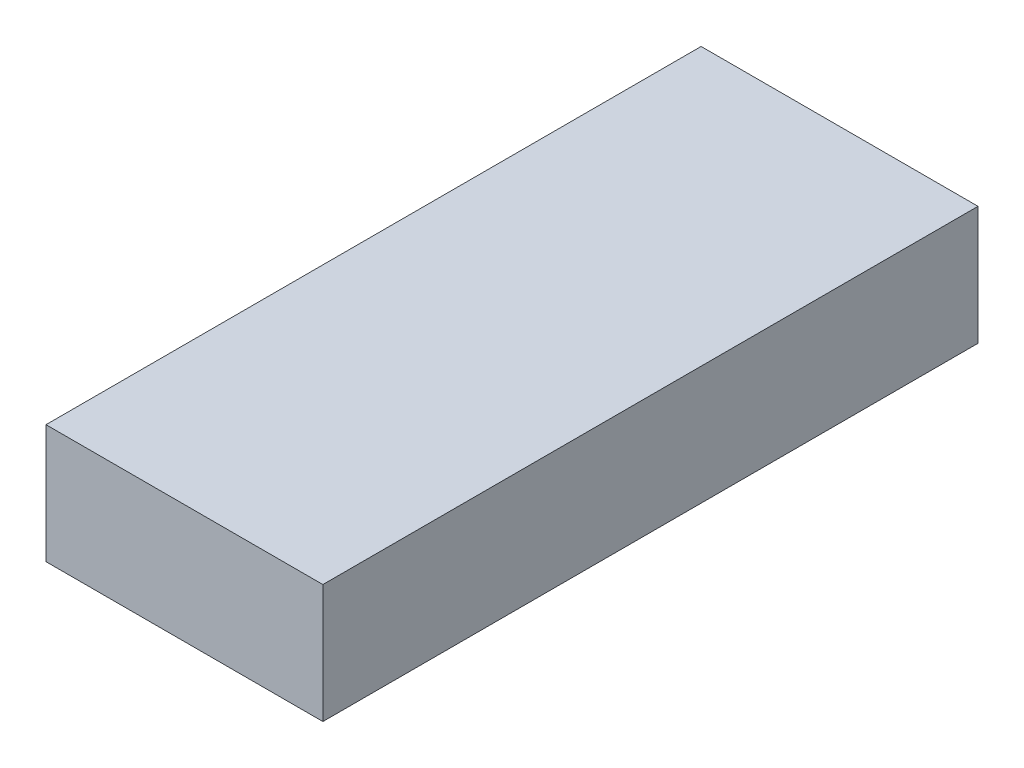
ISO-10303-21;
HEADER;
FILE_DESCRIPTION(('STEP AP214'),'2;1');
FILE_NAME('part.step','',(''),(''),'','','');
FILE_SCHEMA(('AUTOMOTIVE_DESIGN { 1 0 10303 214 1 1 1 1 }'));
ENDSEC;
DATA;
#1=APPLICATION_CONTEXT('core data for automotive mechanical design processes');
#2=APPLICATION_PROTOCOL_DEFINITION('international standard','automotive_design',2000,#1);
#3=PRODUCT_CONTEXT('',#1,'mechanical');
#4=PRODUCT('Part','Part','',(#3));
#5=PRODUCT_RELATED_PRODUCT_CATEGORY('part','',(#4));
#6=PRODUCT_DEFINITION_FORMATION('','',#4);
#7=PRODUCT_DEFINITION_CONTEXT('part definition',#1,'design');
#8=PRODUCT_DEFINITION('design','',#6,#7);
#9=PRODUCT_DEFINITION_SHAPE('','',#8);
#10=(LENGTH_UNIT() NAMED_UNIT(*) SI_UNIT(.MILLI.,.METRE.));
#11=(NAMED_UNIT(*) PLANE_ANGLE_UNIT() SI_UNIT($,.RADIAN.));
#12=(NAMED_UNIT(*) SI_UNIT($,.STERADIAN.) SOLID_ANGLE_UNIT());
#13=UNCERTAINTY_MEASURE_WITH_UNIT(LENGTH_MEASURE(1.E-05),#10,'distance_accuracy_value','');
#14=(GEOMETRIC_REPRESENTATION_CONTEXT(3) GLOBAL_UNCERTAINTY_ASSIGNED_CONTEXT((#13)) GLOBAL_UNIT_ASSIGNED_CONTEXT((#10,
#11,#12)) REPRESENTATION_CONTEXT('',''));
#15=CARTESIAN_POINT('',(0.,0.,0.));
#16=DIRECTION('',(0.,0.,1.));
#17=DIRECTION('',(1.,0.,0.));
#18=AXIS2_PLACEMENT_3D('',#15,#16,#17);
#19=CARTESIAN_POINT('',(-8.99320348145423,41.4962088827548,210.34375));
#20=DIRECTION('',(1.,0.,0.));
#21=DIRECTION('',(0.,1.,0.));
#22=AXIS2_PLACEMENT_3D('',#19,#20,#21);
#23=PLANE('',#22);
#24=DIRECTION('',(0.,-1.,0.));
#25=VECTOR('',#24,1.);
#26=CARTESIAN_POINT('',(-8.99320348145423,41.4962088827548,0.));
#27=LINE('',#26,#25);
#28=CARTESIAN_POINT('',(-8.99320348145423,41.4962088827548,0.));
#29=VERTEX_POINT('',#28);
#30=CARTESIAN_POINT('',(-8.99320348145422,3.3962088827548,0.));
#31=VERTEX_POINT('',#30);
#32=EDGE_CURVE('E95',#29,#31,#27,.T.);
#33=ORIENTED_EDGE('',*,*,#32,.T.);
#34=DIRECTION('',(0.,0.,-1.));
#35=VECTOR('',#34,1.);
#36=CARTESIAN_POINT('',(-8.99320348145422,3.3962088827548,210.34375));
#37=LINE('',#36,#35);
#38=CARTESIAN_POINT('',(-8.99320348145422,3.3962088827548,210.34375));
#39=VERTEX_POINT('',#38);
#40=EDGE_CURVE('E11',#39,#31,#37,.T.);
#41=ORIENTED_EDGE('',*,*,#40,.F.);
#42=DIRECTION('',(0.,-1.,0.));
#43=VECTOR('',#42,1.);
#44=CARTESIAN_POINT('',(-8.99320348145423,41.4962088827548,210.34375));
#45=LINE('',#44,#43);
#46=CARTESIAN_POINT('',(-8.99320348145423,41.4962088827548,210.34375));
#47=VERTEX_POINT('',#46);
#48=EDGE_CURVE('E83',#47,#39,#45,.T.);
#49=ORIENTED_EDGE('',*,*,#48,.F.);
#50=DIRECTION('',(0.,0.,-1.));
#51=VECTOR('',#50,1.);
#52=CARTESIAN_POINT('',(-8.99320348145423,41.4962088827548,210.34375));
#53=LINE('',#52,#51);
#54=EDGE_CURVE('E91',#47,#29,#53,.T.);
#55=ORIENTED_EDGE('',*,*,#54,.T.);
#56=EDGE_LOOP('',(#33,#41,#49,#55));
#57=FACE_BOUND('',#56,.T.);
#58=ADVANCED_FACE('F32',(#57),#23,.F.);
#59=CARTESIAN_POINT('',(-8.99320348145422,3.3962088827548,210.34375));
#60=DIRECTION('',(0.,1.,0.));
#61=DIRECTION('',(0.,0.,1.));
#62=AXIS2_PLACEMENT_3D('',#59,#60,#61);
#63=PLANE('',#62);
#64=DIRECTION('',(1.,0.,0.));
#65=VECTOR('',#64,1.);
#66=CARTESIAN_POINT('',(-8.99320348145422,3.3962088827548,0.));
#67=LINE('',#66,#65);
#68=CARTESIAN_POINT('',(79.9067965185458,3.3962088827548,0.));
#69=VERTEX_POINT('',#68);
#70=EDGE_CURVE('E87',#31,#69,#67,.T.);
#71=ORIENTED_EDGE('',*,*,#70,.T.);
#72=DIRECTION('',(0.,0.,-1.));
#73=VECTOR('',#72,1.);
#74=CARTESIAN_POINT('',(79.9067965185458,3.3962088827548,210.34375));
#75=LINE('',#74,#73);
#76=CARTESIAN_POINT('',(79.9067965185458,3.3962088827548,210.34375));
#77=VERTEX_POINT('',#76);
#78=EDGE_CURVE('E40',#77,#69,#75,.T.);
#79=ORIENTED_EDGE('',*,*,#78,.F.);
#80=DIRECTION('',(1.,0.,0.));
#81=VECTOR('',#80,1.);
#82=CARTESIAN_POINT('',(-8.99320348145422,3.3962088827548,210.34375));
#83=LINE('',#82,#81);
#84=EDGE_CURVE('E78',#39,#77,#83,.T.);
#85=ORIENTED_EDGE('',*,*,#84,.F.);
#86=ORIENTED_EDGE('',*,*,#40,.T.);
#87=EDGE_LOOP('',(#71,#79,#85,#86));
#88=FACE_BOUND('',#87,.T.);
#89=ADVANCED_FACE('F86',(#88),#63,.F.);
#90=CARTESIAN_POINT('',(79.9067965185458,41.4962088827548,210.34375));
#91=DIRECTION('',(-1.,0.,0.));
#92=DIRECTION('',(0.,0.,1.));
#93=AXIS2_PLACEMENT_3D('',#90,#91,#92);
#94=PLANE('',#93);
#95=DIRECTION('',(0.,1.,0.));
#96=VECTOR('',#95,1.);
#97=CARTESIAN_POINT('',(79.9067965185458,41.4962088827548,0.));
#98=LINE('',#97,#96);
#99=CARTESIAN_POINT('',(79.9067965185458,41.4962088827548,0.));
#100=VERTEX_POINT('',#99);
#101=EDGE_CURVE('E65',#69,#100,#98,.T.);
#102=ORIENTED_EDGE('',*,*,#101,.T.);
#103=DIRECTION('',(0.,0.,-1.));
#104=VECTOR('',#103,1.);
#105=CARTESIAN_POINT('',(79.9067965185458,41.4962088827548,210.34375));
#106=LINE('',#105,#104);
#107=CARTESIAN_POINT('',(79.9067965185458,41.4962088827548,210.34375));
#108=VERTEX_POINT('',#107);
#109=EDGE_CURVE('E88',#108,#100,#106,.T.);
#110=ORIENTED_EDGE('',*,*,#109,.F.);
#111=DIRECTION('',(0.,1.,0.));
#112=VECTOR('',#111,1.);
#113=CARTESIAN_POINT('',(79.9067965185458,41.4962088827548,210.34375));
#114=LINE('',#113,#112);
#115=EDGE_CURVE('E81',#77,#108,#114,.T.);
#116=ORIENTED_EDGE('',*,*,#115,.F.);
#117=ORIENTED_EDGE('',*,*,#78,.T.);
#118=EDGE_LOOP('',(#102,#110,#116,#117));
#119=FACE_BOUND('',#118,.T.);
#120=ADVANCED_FACE('F89',(#119),#94,.F.);
#121=CARTESIAN_POINT('',(-8.99320348145423,41.4962088827548,210.34375));
#122=DIRECTION('',(0.,-1.,0.));
#123=DIRECTION('',(0.,0.,-1.));
#124=AXIS2_PLACEMENT_3D('',#121,#122,#123);
#125=PLANE('',#124);
#126=DIRECTION('',(-1.,0.,0.));
#127=VECTOR('',#126,1.);
#128=CARTESIAN_POINT('',(-8.99320348145423,41.4962088827548,0.));
#129=LINE('',#128,#127);
#130=EDGE_CURVE('E71',#100,#29,#129,.T.);
#131=ORIENTED_EDGE('',*,*,#130,.T.);
#132=ORIENTED_EDGE('',*,*,#54,.F.);
#133=DIRECTION('',(-1.,0.,0.));
#134=VECTOR('',#133,1.);
#135=CARTESIAN_POINT('',(-8.99320348145423,41.4962088827548,210.34375));
#136=LINE('',#135,#134);
#137=EDGE_CURVE('E48',#108,#47,#136,.T.);
#138=ORIENTED_EDGE('',*,*,#137,.F.);
#139=ORIENTED_EDGE('',*,*,#109,.T.);
#140=EDGE_LOOP('',(#131,#132,#138,#139));
#141=FACE_BOUND('',#140,.T.);
#142=ADVANCED_FACE('F102',(#141),#125,.F.);
#143=CARTESIAN_POINT('',(0.,0.,210.34375));
#144=DIRECTION('',(0.,0.,1.));
#145=DIRECTION('',(1.,0.,0.));
#146=AXIS2_PLACEMENT_3D('',#143,#144,#145);
#147=PLANE('',#146);
#148=ORIENTED_EDGE('',*,*,#48,.T.);
#149=ORIENTED_EDGE('',*,*,#84,.T.);
#150=ORIENTED_EDGE('',*,*,#115,.T.);
#151=ORIENTED_EDGE('',*,*,#137,.T.);
#152=EDGE_LOOP('',(#148,#149,#150,#151));
#153=FACE_BOUND('',#152,.T.);
#154=ADVANCED_FACE('F79',(#153),#147,.T.);
#155=CARTESIAN_POINT('',(0.,0.,0.));
#156=DIRECTION('',(0.,0.,1.));
#157=DIRECTION('',(1.,0.,0.));
#158=AXIS2_PLACEMENT_3D('',#155,#156,#157);
#159=PLANE('',#158);
#160=ORIENTED_EDGE('',*,*,#32,.F.);
#161=ORIENTED_EDGE('',*,*,#130,.F.);
#162=ORIENTED_EDGE('',*,*,#101,.F.);
#163=ORIENTED_EDGE('',*,*,#70,.F.);
#164=EDGE_LOOP('',(#160,#161,#162,#163));
#165=FACE_BOUND('',#164,.T.);
#166=ADVANCED_FACE('F105',(#165),#159,.F.);
#167=CLOSED_SHELL('',(#58,#89,#120,#142,#154,#166));
#168=MANIFOLD_SOLID_BREP('B2',#167);
#169=ADVANCED_BREP_SHAPE_REPRESENTATION('',(#18,#168),#14);
#170=SHAPE_DEFINITION_REPRESENTATION(#9,#169);
ENDSEC;
END-ISO-10303-21;
